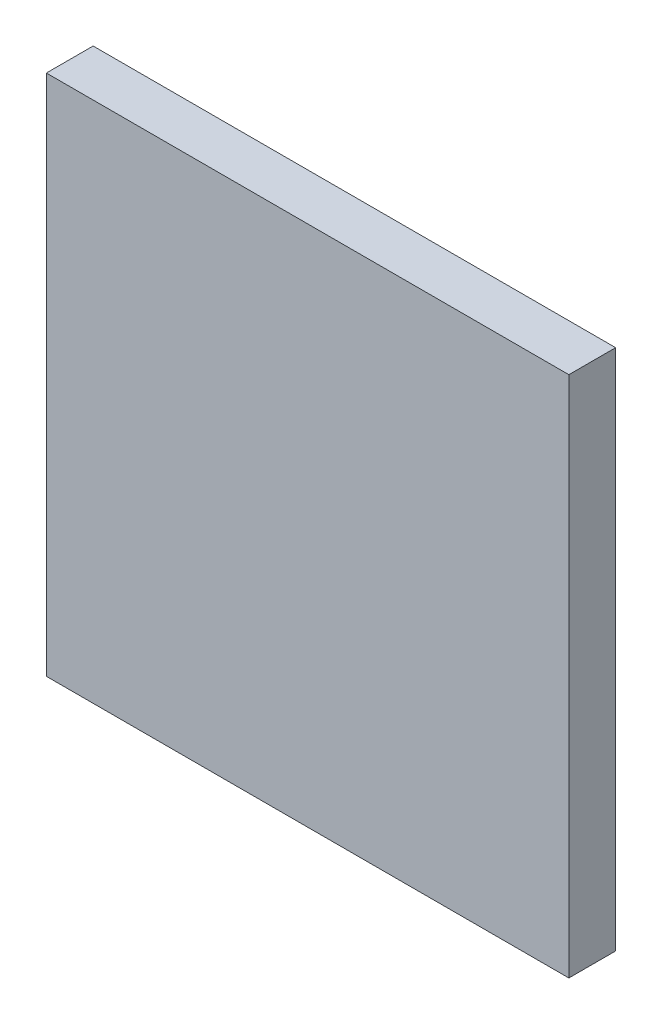
ISO-10303-21;
HEADER;
FILE_DESCRIPTION(('STEP AP214'),'2;1');
FILE_NAME('part.step','',(''),(''),'','','');
FILE_SCHEMA(('AUTOMOTIVE_DESIGN { 1 0 10303 214 1 1 1 1 }'));
ENDSEC;
DATA;
#1=APPLICATION_CONTEXT('core data for automotive mechanical design processes');
#2=APPLICATION_PROTOCOL_DEFINITION('international standard','automotive_design',2000,#1);
#3=PRODUCT_CONTEXT('',#1,'mechanical');
#4=PRODUCT('Part','Part','',(#3));
#5=PRODUCT_RELATED_PRODUCT_CATEGORY('part','',(#4));
#6=PRODUCT_DEFINITION_FORMATION('','',#4);
#7=PRODUCT_DEFINITION_CONTEXT('part definition',#1,'design');
#8=PRODUCT_DEFINITION('design','',#6,#7);
#9=PRODUCT_DEFINITION_SHAPE('','',#8);
#10=(LENGTH_UNIT() NAMED_UNIT(*) SI_UNIT(.MILLI.,.METRE.));
#11=(NAMED_UNIT(*) PLANE_ANGLE_UNIT() SI_UNIT($,.RADIAN.));
#12=(NAMED_UNIT(*) SI_UNIT($,.STERADIAN.) SOLID_ANGLE_UNIT());
#13=UNCERTAINTY_MEASURE_WITH_UNIT(LENGTH_MEASURE(1.E-05),#10,'distance_accuracy_value','');
#14=(GEOMETRIC_REPRESENTATION_CONTEXT(3) GLOBAL_UNCERTAINTY_ASSIGNED_CONTEXT((#13)) GLOBAL_UNIT_ASSIGNED_CONTEXT((#10,
#11,#12)) REPRESENTATION_CONTEXT('',''));
#15=CARTESIAN_POINT('',(0.,0.,0.));
#16=DIRECTION('',(0.,0.,1.));
#17=DIRECTION('',(1.,0.,0.));
#18=AXIS2_PLACEMENT_3D('',#15,#16,#17);
#19=CARTESIAN_POINT('',(-79.9084000000002,73.8885999999999,1.58749999999988));
#20=DIRECTION('',(0.,-1.,0.));
#21=DIRECTION('',(0.,0.,-1.));
#22=AXIS2_PLACEMENT_3D('',#19,#20,#21);
#23=PLANE('',#22);
#24=DIRECTION('',(-1.,0.,0.));
#25=VECTOR('',#24,1.);
#26=CARTESIAN_POINT('',(-79.9084000000002,73.8885999999999,0.));
#27=LINE('',#26,#25);
#28=CARTESIAN_POINT('',(-79.9084000000002,73.8885999999999,0.));
#29=VERTEX_POINT('',#28);
#30=CARTESIAN_POINT('',(-97.6376000000001,73.8886000000001,1.38777878078145E-13));
#31=VERTEX_POINT('',#30);
#32=EDGE_CURVE('E95',#29,#31,#27,.T.);
#33=ORIENTED_EDGE('',*,*,#32,.T.);
#34=DIRECTION('',(0.,0.,-1.));
#35=VECTOR('',#34,1.);
#36=CARTESIAN_POINT('',(-97.6376000000001,73.8886000000001,1.58749999999988));
#37=LINE('',#36,#35);
#38=CARTESIAN_POINT('',(-97.6376000000001,73.8886000000001,1.58749999999988));
#39=VERTEX_POINT('',#38);
#40=EDGE_CURVE('E11',#39,#31,#37,.T.);
#41=ORIENTED_EDGE('',*,*,#40,.F.);
#42=DIRECTION('',(-1.,0.,0.));
#43=VECTOR('',#42,1.);
#44=CARTESIAN_POINT('',(-79.9084000000002,73.8885999999999,1.58749999999988));
#45=LINE('',#44,#43);
#46=CARTESIAN_POINT('',(-79.9084000000002,73.8885999999999,1.58749999999988));
#47=VERTEX_POINT('',#46);
#48=EDGE_CURVE('E83',#47,#39,#45,.T.);
#49=ORIENTED_EDGE('',*,*,#48,.F.);
#50=DIRECTION('',(0.,0.,-1.));
#51=VECTOR('',#50,1.);
#52=CARTESIAN_POINT('',(-79.9084000000002,73.8885999999999,1.58749999999988));
#53=LINE('',#52,#51);
#54=EDGE_CURVE('E91',#47,#29,#53,.T.);
#55=ORIENTED_EDGE('',*,*,#54,.T.);
#56=EDGE_LOOP('',(#33,#41,#49,#55));
#57=FACE_BOUND('',#56,.T.);
#58=ADVANCED_FACE('F32',(#57),#23,.F.);
#59=CARTESIAN_POINT('',(-97.6376000000001,73.8886000000001,1.58749999999988));
#60=DIRECTION('',(1.,0.,0.));
#61=DIRECTION('',(0.,0.,-1.));
#62=AXIS2_PLACEMENT_3D('',#59,#60,#61);
#63=PLANE('',#62);
#64=DIRECTION('',(0.,-1.,0.));
#65=VECTOR('',#64,1.);
#66=CARTESIAN_POINT('',(-97.6376000000001,73.8886000000001,1.38777878078145E-13));
#67=LINE('',#66,#65);
#68=CARTESIAN_POINT('',(-97.6376000000002,56.1594,0.));
#69=VERTEX_POINT('',#68);
#70=EDGE_CURVE('E87',#31,#69,#67,.T.);
#71=ORIENTED_EDGE('',*,*,#70,.T.);
#72=DIRECTION('',(0.,0.,-1.));
#73=VECTOR('',#72,1.);
#74=CARTESIAN_POINT('',(-97.6376000000002,56.1594,1.58750000000013));
#75=LINE('',#74,#73);
#76=CARTESIAN_POINT('',(-97.6376000000002,56.1594,1.58750000000013));
#77=VERTEX_POINT('',#76);
#78=EDGE_CURVE('E40',#77,#69,#75,.T.);
#79=ORIENTED_EDGE('',*,*,#78,.F.);
#80=DIRECTION('',(0.,-1.,0.));
#81=VECTOR('',#80,1.);
#82=CARTESIAN_POINT('',(-97.6376000000001,73.8886000000001,1.58749999999988));
#83=LINE('',#82,#81);
#84=EDGE_CURVE('E78',#39,#77,#83,.T.);
#85=ORIENTED_EDGE('',*,*,#84,.F.);
#86=ORIENTED_EDGE('',*,*,#40,.T.);
#87=EDGE_LOOP('',(#71,#79,#85,#86));
#88=FACE_BOUND('',#87,.T.);
#89=ADVANCED_FACE('F86',(#88),#63,.F.);
#90=CARTESIAN_POINT('',(-97.6376000000002,56.1594,1.58750000000013));
#91=DIRECTION('',(0.,1.,0.));
#92=DIRECTION('',(-1.,0.,0.));
#93=AXIS2_PLACEMENT_3D('',#90,#91,#92);
#94=PLANE('',#93);
#95=DIRECTION('',(1.,0.,0.));
#96=VECTOR('',#95,1.);
#97=CARTESIAN_POINT('',(-97.6376000000002,56.1594,0.));
#98=LINE('',#97,#96);
#99=CARTESIAN_POINT('',(-79.9084000000002,56.1594000000001,0.));
#100=VERTEX_POINT('',#99);
#101=EDGE_CURVE('E65',#69,#100,#98,.T.);
#102=ORIENTED_EDGE('',*,*,#101,.T.);
#103=DIRECTION('',(0.,0.,-1.));
#104=VECTOR('',#103,1.);
#105=CARTESIAN_POINT('',(-79.9084000000002,56.1594000000001,1.5875000000001));
#106=LINE('',#105,#104);
#107=CARTESIAN_POINT('',(-79.9084000000002,56.1594000000001,1.5875000000001));
#108=VERTEX_POINT('',#107);
#109=EDGE_CURVE('E88',#108,#100,#106,.T.);
#110=ORIENTED_EDGE('',*,*,#109,.F.);
#111=DIRECTION('',(1.,0.,0.));
#112=VECTOR('',#111,1.);
#113=CARTESIAN_POINT('',(-97.6376000000002,56.1594,1.58750000000013));
#114=LINE('',#113,#112);
#115=EDGE_CURVE('E81',#77,#108,#114,.T.);
#116=ORIENTED_EDGE('',*,*,#115,.F.);
#117=ORIENTED_EDGE('',*,*,#78,.T.);
#118=EDGE_LOOP('',(#102,#110,#116,#117));
#119=FACE_BOUND('',#118,.T.);
#120=ADVANCED_FACE('F89',(#119),#94,.F.);
#121=CARTESIAN_POINT('',(-79.9084000000002,56.1594000000001,1.5875000000001));
#122=DIRECTION('',(-1.,0.,0.));
#123=DIRECTION('',(0.,0.,1.));
#124=AXIS2_PLACEMENT_3D('',#121,#122,#123);
#125=PLANE('',#124);
#126=DIRECTION('',(0.,1.,0.));
#127=VECTOR('',#126,1.);
#128=CARTESIAN_POINT('',(-79.9084000000002,56.1594000000001,0.));
#129=LINE('',#128,#127);
#130=EDGE_CURVE('E71',#100,#29,#129,.T.);
#131=ORIENTED_EDGE('',*,*,#130,.T.);
#132=ORIENTED_EDGE('',*,*,#54,.F.);
#133=DIRECTION('',(0.,1.,0.));
#134=VECTOR('',#133,1.);
#135=CARTESIAN_POINT('',(-79.9084000000002,56.1594000000001,1.5875000000001));
#136=LINE('',#135,#134);
#137=EDGE_CURVE('E48',#108,#47,#136,.T.);
#138=ORIENTED_EDGE('',*,*,#137,.F.);
#139=ORIENTED_EDGE('',*,*,#109,.T.);
#140=EDGE_LOOP('',(#131,#132,#138,#139));
#141=FACE_BOUND('',#140,.T.);
#142=ADVANCED_FACE('F102',(#141),#125,.F.);
#143=CARTESIAN_POINT('',(0.,0.,1.58750000000007));
#144=DIRECTION('',(0.,0.,1.));
#145=DIRECTION('',(1.,0.,0.));
#146=AXIS2_PLACEMENT_3D('',#143,#144,#145);
#147=PLANE('',#146);
#148=ORIENTED_EDGE('',*,*,#48,.T.);
#149=ORIENTED_EDGE('',*,*,#84,.T.);
#150=ORIENTED_EDGE('',*,*,#115,.T.);
#151=ORIENTED_EDGE('',*,*,#137,.T.);
#152=EDGE_LOOP('',(#148,#149,#150,#151));
#153=FACE_BOUND('',#152,.T.);
#154=ADVANCED_FACE('F79',(#153),#147,.T.);
#155=CARTESIAN_POINT('',(0.,0.,0.));
#156=DIRECTION('',(0.,0.,1.));
#157=DIRECTION('',(1.,0.,0.));
#158=AXIS2_PLACEMENT_3D('',#155,#156,#157);
#159=PLANE('',#158);
#160=ORIENTED_EDGE('',*,*,#32,.F.);
#161=ORIENTED_EDGE('',*,*,#130,.F.);
#162=ORIENTED_EDGE('',*,*,#101,.F.);
#163=ORIENTED_EDGE('',*,*,#70,.F.);
#164=EDGE_LOOP('',(#160,#161,#162,#163));
#165=FACE_BOUND('',#164,.T.);
#166=ADVANCED_FACE('F105',(#165),#159,.F.);
#167=CLOSED_SHELL('',(#58,#89,#120,#142,#154,#166));
#168=MANIFOLD_SOLID_BREP('B2',#167);
#169=ADVANCED_BREP_SHAPE_REPRESENTATION('',(#18,#168),#14);
#170=SHAPE_DEFINITION_REPRESENTATION(#9,#169);
ENDSEC;
END-ISO-10303-21;
